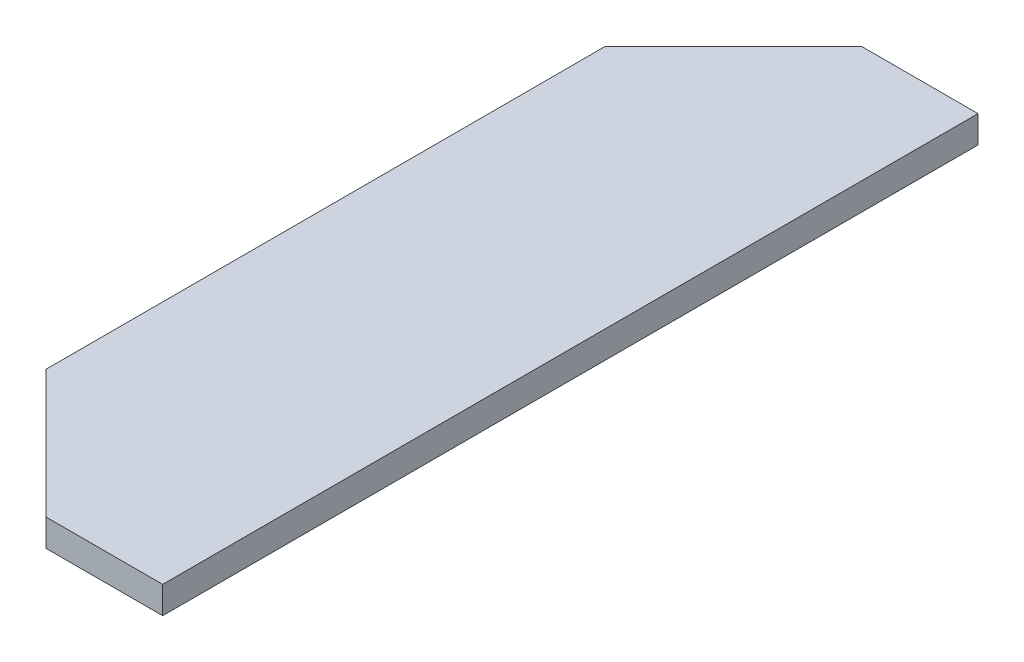
ISO-10303-21;
HEADER;
FILE_DESCRIPTION(('STEP AP214'),'2;1');
FILE_NAME('part.step','',(''),(''),'','','');
FILE_SCHEMA(('AUTOMOTIVE_DESIGN { 1 0 10303 214 1 1 1 1 }'));
ENDSEC;
DATA;
#1=APPLICATION_CONTEXT('core data for automotive mechanical design processes');
#2=APPLICATION_PROTOCOL_DEFINITION('international standard','automotive_design',2000,#1);
#3=PRODUCT_CONTEXT('',#1,'mechanical');
#4=PRODUCT('Part','Part','',(#3));
#5=PRODUCT_RELATED_PRODUCT_CATEGORY('part','',(#4));
#6=PRODUCT_DEFINITION_FORMATION('','',#4);
#7=PRODUCT_DEFINITION_CONTEXT('part definition',#1,'design');
#8=PRODUCT_DEFINITION('design','',#6,#7);
#9=PRODUCT_DEFINITION_SHAPE('','',#8);
#10=(LENGTH_UNIT() NAMED_UNIT(*) SI_UNIT(.MILLI.,.METRE.));
#11=(NAMED_UNIT(*) PLANE_ANGLE_UNIT() SI_UNIT($,.RADIAN.));
#12=(NAMED_UNIT(*) SI_UNIT($,.STERADIAN.) SOLID_ANGLE_UNIT());
#13=UNCERTAINTY_MEASURE_WITH_UNIT(LENGTH_MEASURE(1.E-05),#10,'distance_accuracy_value','');
#14=(GEOMETRIC_REPRESENTATION_CONTEXT(3) GLOBAL_UNCERTAINTY_ASSIGNED_CONTEXT((#13)) GLOBAL_UNIT_ASSIGNED_CONTEXT((#10,
#11,#12)) REPRESENTATION_CONTEXT('',''));
#15=CARTESIAN_POINT('',(0.,0.,0.));
#16=DIRECTION('',(0.,0.,1.));
#17=DIRECTION('',(1.,0.,0.));
#18=AXIS2_PLACEMENT_3D('',#15,#16,#17);
#19=CARTESIAN_POINT('',(45.,10.,150.));
#20=DIRECTION('',(-1.,0.,0.));
#21=DIRECTION('',(0.,0.,1.));
#22=AXIS2_PLACEMENT_3D('',#19,#20,#21);
#23=PLANE('',#22);
#24=DIRECTION('',(0.,0.,-1.));
#25=VECTOR('',#24,1.);
#26=CARTESIAN_POINT('',(45.,0.,150.));
#27=LINE('',#26,#25);
#28=CARTESIAN_POINT('',(45.,0.,150.));
#29=VERTEX_POINT('',#28);
#30=CARTESIAN_POINT('',(45.,0.,-150.));
#31=VERTEX_POINT('',#30);
#32=EDGE_CURVE('E128',#29,#31,#27,.T.);
#33=ORIENTED_EDGE('',*,*,#32,.T.);
#34=DIRECTION('',(0.,-1.,0.));
#35=VECTOR('',#34,1.);
#36=CARTESIAN_POINT('',(45.,10.,-150.));
#37=LINE('',#36,#35);
#38=CARTESIAN_POINT('',(45.,10.,-150.));
#39=VERTEX_POINT('',#38);
#40=EDGE_CURVE('E11',#39,#31,#37,.T.);
#41=ORIENTED_EDGE('',*,*,#40,.F.);
#42=DIRECTION('',(0.,0.,-1.));
#43=VECTOR('',#42,1.);
#44=CARTESIAN_POINT('',(45.,10.,150.));
#45=LINE('',#44,#43);
#46=CARTESIAN_POINT('',(45.,10.,150.));
#47=VERTEX_POINT('',#46);
#48=EDGE_CURVE('E144',#47,#39,#45,.T.);
#49=ORIENTED_EDGE('',*,*,#48,.F.);
#50=DIRECTION('',(0.,-1.,0.));
#51=VECTOR('',#50,1.);
#52=CARTESIAN_POINT('',(45.,10.,150.));
#53=LINE('',#52,#51);
#54=EDGE_CURVE('E124',#47,#29,#53,.T.);
#55=ORIENTED_EDGE('',*,*,#54,.T.);
#56=EDGE_LOOP('',(#33,#41,#49,#55));
#57=FACE_BOUND('',#56,.T.);
#58=ADVANCED_FACE('F39',(#57),#23,.F.);
#59=CARTESIAN_POINT('',(45.,10.,-150.));
#60=DIRECTION('',(0.,0.,1.));
#61=DIRECTION('',(1.,0.,0.));
#62=AXIS2_PLACEMENT_3D('',#59,#60,#61);
#63=PLANE('',#62);
#64=DIRECTION('',(-1.,0.,0.));
#65=VECTOR('',#64,1.);
#66=CARTESIAN_POINT('',(45.,0.,-150.));
#67=LINE('',#66,#65);
#68=CARTESIAN_POINT('',(2.07106781186545,0.,-150.));
#69=VERTEX_POINT('',#68);
#70=EDGE_CURVE('E132',#31,#69,#67,.T.);
#71=ORIENTED_EDGE('',*,*,#70,.T.);
#72=DIRECTION('',(0.,-1.,0.));
#73=VECTOR('',#72,1.);
#74=CARTESIAN_POINT('',(2.07106781186545,10.,-150.));
#75=LINE('',#74,#73);
#76=CARTESIAN_POINT('',(2.07106781186545,10.,-150.));
#77=VERTEX_POINT('',#76);
#78=EDGE_CURVE('E48',#77,#69,#75,.T.);
#79=ORIENTED_EDGE('',*,*,#78,.F.);
#80=DIRECTION('',(-1.,0.,0.));
#81=VECTOR('',#80,1.);
#82=CARTESIAN_POINT('',(45.,10.,-150.));
#83=LINE('',#82,#81);
#84=EDGE_CURVE('E93',#39,#77,#83,.T.);
#85=ORIENTED_EDGE('',*,*,#84,.F.);
#86=ORIENTED_EDGE('',*,*,#40,.T.);
#87=EDGE_LOOP('',(#71,#79,#85,#86));
#88=FACE_BOUND('',#87,.T.);
#89=ADVANCED_FACE('F172',(#88),#63,.F.);
#90=CARTESIAN_POINT('',(2.07106781186545,10.,-150.));
#91=DIRECTION('',(0.707106781186548,0.,0.707106781186548));
#92=DIRECTION('',(0.707106781186548,0.,-0.707106781186548));
#93=AXIS2_PLACEMENT_3D('',#90,#91,#92);
#94=PLANE('',#93);
#95=DIRECTION('',(-0.707106781186548,0.,0.707106781186548));
#96=VECTOR('',#95,1.);
#97=CARTESIAN_POINT('',(2.07106781186545,0.,-150.));
#98=LINE('',#97,#96);
#99=CARTESIAN_POINT('',(-45.,0.,-102.928932188135));
#100=VERTEX_POINT('',#99);
#101=EDGE_CURVE('E135',#69,#100,#98,.T.);
#102=ORIENTED_EDGE('',*,*,#101,.T.);
#103=DIRECTION('',(0.,-1.,0.));
#104=VECTOR('',#103,1.);
#105=CARTESIAN_POINT('',(-45.,10.,-102.928932188135));
#106=LINE('',#105,#104);
#107=CARTESIAN_POINT('',(-45.,10.,-102.928932188135));
#108=VERTEX_POINT('',#107);
#109=EDGE_CURVE('E117',#108,#100,#106,.T.);
#110=ORIENTED_EDGE('',*,*,#109,.F.);
#111=DIRECTION('',(-0.707106781186548,0.,0.707106781186548));
#112=VECTOR('',#111,1.);
#113=CARTESIAN_POINT('',(2.07106781186545,10.,-150.));
#114=LINE('',#113,#112);
#115=EDGE_CURVE('E106',#77,#108,#114,.T.);
#116=ORIENTED_EDGE('',*,*,#115,.F.);
#117=ORIENTED_EDGE('',*,*,#78,.T.);
#118=EDGE_LOOP('',(#102,#110,#116,#117));
#119=FACE_BOUND('',#118,.T.);
#120=ADVANCED_FACE('F154',(#119),#94,.F.);
#121=CARTESIAN_POINT('',(-45.,10.,-102.928932188135));
#122=DIRECTION('',(1.,0.,0.));
#123=DIRECTION('',(0.,0.,-1.));
#124=AXIS2_PLACEMENT_3D('',#121,#122,#123);
#125=PLANE('',#124);
#126=DIRECTION('',(0.,0.,1.));
#127=VECTOR('',#126,1.);
#128=CARTESIAN_POINT('',(-45.,0.,-102.928932188135));
#129=LINE('',#128,#127);
#130=CARTESIAN_POINT('',(-45.,0.,102.928932188135));
#131=VERTEX_POINT('',#130);
#132=EDGE_CURVE('E115',#100,#131,#129,.T.);
#133=ORIENTED_EDGE('',*,*,#132,.T.);
#134=DIRECTION('',(0.,-1.,0.));
#135=VECTOR('',#134,1.);
#136=CARTESIAN_POINT('',(-45.,10.,102.928932188135));
#137=LINE('',#136,#135);
#138=CARTESIAN_POINT('',(-45.,10.,102.928932188135));
#139=VERTEX_POINT('',#138);
#140=EDGE_CURVE('E112',#139,#131,#137,.T.);
#141=ORIENTED_EDGE('',*,*,#140,.F.);
#142=DIRECTION('',(0.,0.,1.));
#143=VECTOR('',#142,1.);
#144=CARTESIAN_POINT('',(-45.,10.,-102.928932188135));
#145=LINE('',#144,#143);
#146=EDGE_CURVE('E100',#108,#139,#145,.T.);
#147=ORIENTED_EDGE('',*,*,#146,.F.);
#148=ORIENTED_EDGE('',*,*,#109,.T.);
#149=EDGE_LOOP('',(#133,#141,#147,#148));
#150=FACE_BOUND('',#149,.T.);
#151=ADVANCED_FACE('F113',(#150),#125,.F.);
#152=CARTESIAN_POINT('',(-45.,10.,102.928932188135));
#153=DIRECTION('',(0.707106781186548,0.,-0.707106781186548));
#154=DIRECTION('',(-0.707106781186548,0.,-0.707106781186548));
#155=AXIS2_PLACEMENT_3D('',#152,#153,#154);
#156=PLANE('',#155);
#157=DIRECTION('',(0.707106781186548,0.,0.707106781186548));
#158=VECTOR('',#157,1.);
#159=CARTESIAN_POINT('',(-45.,0.,102.928932188135));
#160=LINE('',#159,#158);
#161=CARTESIAN_POINT('',(2.07106781186545,0.,150.));
#162=VERTEX_POINT('',#161);
#163=EDGE_CURVE('E79',#131,#162,#160,.T.);
#164=ORIENTED_EDGE('',*,*,#163,.T.);
#165=DIRECTION('',(0.,-1.,0.));
#166=VECTOR('',#165,1.);
#167=CARTESIAN_POINT('',(2.07106781186545,10.,150.));
#168=LINE('',#167,#166);
#169=CARTESIAN_POINT('',(2.07106781186545,10.,150.));
#170=VERTEX_POINT('',#169);
#171=EDGE_CURVE('E118',#170,#162,#168,.T.);
#172=ORIENTED_EDGE('',*,*,#171,.F.);
#173=DIRECTION('',(0.707106781186548,0.,0.707106781186548));
#174=VECTOR('',#173,1.);
#175=CARTESIAN_POINT('',(-45.,10.,102.928932188135));
#176=LINE('',#175,#174);
#177=EDGE_CURVE('E104',#139,#170,#176,.T.);
#178=ORIENTED_EDGE('',*,*,#177,.F.);
#179=ORIENTED_EDGE('',*,*,#140,.T.);
#180=EDGE_LOOP('',(#164,#172,#178,#179));
#181=FACE_BOUND('',#180,.T.);
#182=ADVANCED_FACE('F120',(#181),#156,.F.);
#183=CARTESIAN_POINT('',(2.07106781186545,10.,150.));
#184=DIRECTION('',(0.,0.,-1.));
#185=DIRECTION('',(-1.,0.,0.));
#186=AXIS2_PLACEMENT_3D('',#183,#184,#185);
#187=PLANE('',#186);
#188=DIRECTION('',(1.,0.,0.));
#189=VECTOR('',#188,1.);
#190=CARTESIAN_POINT('',(2.07106781186545,0.,150.));
#191=LINE('',#190,#189);
#192=EDGE_CURVE('E85',#162,#29,#191,.T.);
#193=ORIENTED_EDGE('',*,*,#192,.T.);
#194=ORIENTED_EDGE('',*,*,#54,.F.);
#195=DIRECTION('',(1.,0.,0.));
#196=VECTOR('',#195,1.);
#197=CARTESIAN_POINT('',(2.07106781186545,10.,150.));
#198=LINE('',#197,#196);
#199=EDGE_CURVE('E56',#170,#47,#198,.T.);
#200=ORIENTED_EDGE('',*,*,#199,.F.);
#201=ORIENTED_EDGE('',*,*,#171,.T.);
#202=EDGE_LOOP('',(#193,#194,#200,#201));
#203=FACE_BOUND('',#202,.T.);
#204=ADVANCED_FACE('F161',(#203),#187,.F.);
#205=CARTESIAN_POINT('',(0.,10.,0.));
#206=DIRECTION('',(0.,1.,0.));
#207=DIRECTION('',(0.,0.,1.));
#208=AXIS2_PLACEMENT_3D('',#205,#206,#207);
#209=PLANE('',#208);
#210=ORIENTED_EDGE('',*,*,#48,.T.);
#211=ORIENTED_EDGE('',*,*,#84,.T.);
#212=ORIENTED_EDGE('',*,*,#115,.T.);
#213=ORIENTED_EDGE('',*,*,#146,.T.);
#214=ORIENTED_EDGE('',*,*,#177,.T.);
#215=ORIENTED_EDGE('',*,*,#199,.T.);
#216=EDGE_LOOP('',(#210,#211,#212,#213,#214,#215));
#217=FACE_BOUND('',#216,.T.);
#218=ADVANCED_FACE('F102',(#217),#209,.T.);
#219=CARTESIAN_POINT('',(0.,0.,0.));
#220=DIRECTION('',(0.,1.,0.));
#221=DIRECTION('',(0.,0.,1.));
#222=AXIS2_PLACEMENT_3D('',#219,#220,#221);
#223=PLANE('',#222);
#224=ORIENTED_EDGE('',*,*,#32,.F.);
#225=ORIENTED_EDGE('',*,*,#192,.F.);
#226=ORIENTED_EDGE('',*,*,#163,.F.);
#227=ORIENTED_EDGE('',*,*,#132,.F.);
#228=ORIENTED_EDGE('',*,*,#101,.F.);
#229=ORIENTED_EDGE('',*,*,#70,.F.);
#230=EDGE_LOOP('',(#224,#225,#226,#227,#228,#229));
#231=FACE_BOUND('',#230,.T.);
#232=ADVANCED_FACE('F157',(#231),#223,.F.);
#233=CLOSED_SHELL('',(#58,#89,#120,#151,#182,#204,#218,#232));
#234=MANIFOLD_SOLID_BREP('B2',#233);
#235=ADVANCED_BREP_SHAPE_REPRESENTATION('',(#18,#234),#14);
#236=SHAPE_DEFINITION_REPRESENTATION(#9,#235);
ENDSEC;
END-ISO-10303-21;
